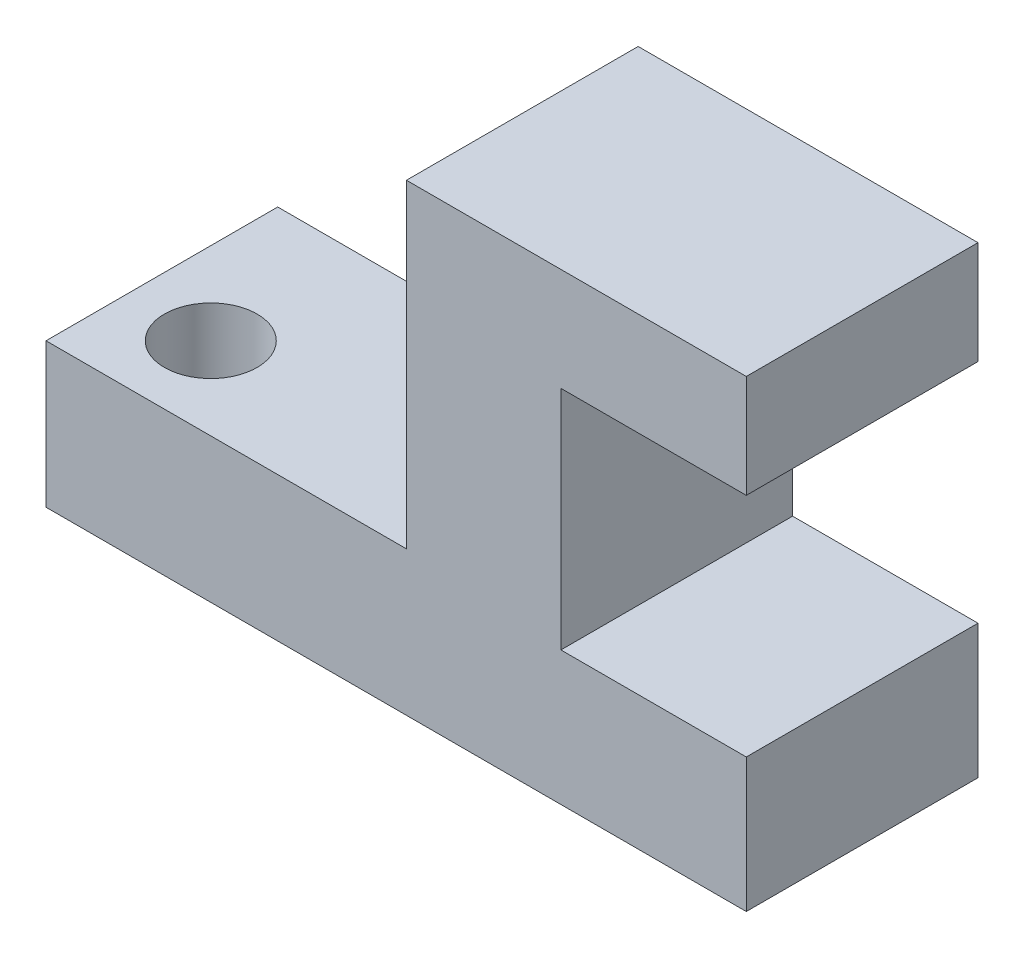
ISO-10303-21;
HEADER;
FILE_DESCRIPTION(('STEP AP214'),'2;1');
FILE_NAME('part.step','',(''),(''),'','','');
FILE_SCHEMA(('AUTOMOTIVE_DESIGN { 1 0 10303 214 1 1 1 1 }'));
ENDSEC;
DATA;
#1=APPLICATION_CONTEXT('core data for automotive mechanical design processes');
#2=APPLICATION_PROTOCOL_DEFINITION('international standard','automotive_design',2000,#1);
#3=PRODUCT_CONTEXT('',#1,'mechanical');
#4=PRODUCT('Part','Part','',(#3));
#5=PRODUCT_RELATED_PRODUCT_CATEGORY('part','',(#4));
#6=PRODUCT_DEFINITION_FORMATION('','',#4);
#7=PRODUCT_DEFINITION_CONTEXT('part definition',#1,'design');
#8=PRODUCT_DEFINITION('design','',#6,#7);
#9=PRODUCT_DEFINITION_SHAPE('','',#8);
#10=(LENGTH_UNIT() NAMED_UNIT(*) SI_UNIT(.MILLI.,.METRE.));
#11=(NAMED_UNIT(*) PLANE_ANGLE_UNIT() SI_UNIT($,.RADIAN.));
#12=(NAMED_UNIT(*) SI_UNIT($,.STERADIAN.) SOLID_ANGLE_UNIT());
#13=UNCERTAINTY_MEASURE_WITH_UNIT(LENGTH_MEASURE(1.E-05),#10,'distance_accuracy_value','');
#14=(GEOMETRIC_REPRESENTATION_CONTEXT(3) GLOBAL_UNCERTAINTY_ASSIGNED_CONTEXT((#13)) GLOBAL_UNIT_ASSIGNED_CONTEXT((#10,
#11,#12)) REPRESENTATION_CONTEXT('',''));
#15=CARTESIAN_POINT('',(0.,0.,0.));
#16=DIRECTION('',(0.,0.,1.));
#17=DIRECTION('',(1.,0.,0.));
#18=AXIS2_PLACEMENT_3D('',#15,#16,#17);
#19=CARTESIAN_POINT('',(0.,2.6,4.5));
#20=DIRECTION('',(-1.,0.,0.));
#21=DIRECTION('',(0.,-1.,0.));
#22=AXIS2_PLACEMENT_3D('',#19,#20,#21);
#23=PLANE('',#22);
#24=DIRECTION('',(0.,1.,0.));
#25=VECTOR('',#24,1.);
#26=CARTESIAN_POINT('',(0.,2.6,0.));
#27=LINE('',#26,#25);
#28=CARTESIAN_POINT('',(0.,0.,0.));
#29=VERTEX_POINT('',#28);
#30=CARTESIAN_POINT('',(0.,2.6,0.));
#31=VERTEX_POINT('',#30);
#32=EDGE_CURVE('E143',#29,#31,#27,.T.);
#33=ORIENTED_EDGE('',*,*,#32,.T.);
#34=DIRECTION('',(0.,0.,-1.));
#35=VECTOR('',#34,1.);
#36=CARTESIAN_POINT('',(0.,2.6,4.5));
#37=LINE('',#36,#35);
#38=CARTESIAN_POINT('',(0.,2.6,4.5));
#39=VERTEX_POINT('',#38);
#40=EDGE_CURVE('E11',#39,#31,#37,.T.);
#41=ORIENTED_EDGE('',*,*,#40,.F.);
#42=DIRECTION('',(0.,1.,0.));
#43=VECTOR('',#42,1.);
#44=CARTESIAN_POINT('',(0.,2.6,4.5));
#45=LINE('',#44,#43);
#46=CARTESIAN_POINT('',(0.,0.,4.5));
#47=VERTEX_POINT('',#46);
#48=EDGE_CURVE('E161',#47,#39,#45,.T.);
#49=ORIENTED_EDGE('',*,*,#48,.F.);
#50=DIRECTION('',(0.,0.,-1.));
#51=VECTOR('',#50,1.);
#52=CARTESIAN_POINT('',(0.,0.,4.5));
#53=LINE('',#52,#51);
#54=EDGE_CURVE('E139',#47,#29,#53,.T.);
#55=ORIENTED_EDGE('',*,*,#54,.T.);
#56=EDGE_LOOP('',(#33,#41,#49,#55));
#57=FACE_BOUND('',#56,.T.);
#58=ADVANCED_FACE('F33',(#57),#23,.F.);
#59=CARTESIAN_POINT('',(-3.6,2.6,4.5));
#60=DIRECTION('',(0.,-1.,0.));
#61=DIRECTION('',(0.,0.,-1.));
#62=AXIS2_PLACEMENT_3D('',#59,#60,#61);
#63=PLANE('',#62);
#64=DIRECTION('',(-1.,0.,0.));
#65=VECTOR('',#64,1.);
#66=CARTESIAN_POINT('',(-3.6,2.6,0.));
#67=LINE('',#66,#65);
#68=CARTESIAN_POINT('',(-3.6,2.6,0.));
#69=VERTEX_POINT('',#68);
#70=EDGE_CURVE('E146',#31,#69,#67,.T.);
#71=ORIENTED_EDGE('',*,*,#70,.T.);
#72=DIRECTION('',(0.,0.,-1.));
#73=VECTOR('',#72,1.);
#74=CARTESIAN_POINT('',(-3.6,2.6,4.5));
#75=LINE('',#74,#73);
#76=CARTESIAN_POINT('',(-3.6,2.6,4.5));
#77=VERTEX_POINT('',#76);
#78=EDGE_CURVE('E42',#77,#69,#75,.T.);
#79=ORIENTED_EDGE('',*,*,#78,.F.);
#80=DIRECTION('',(-1.,0.,0.));
#81=VECTOR('',#80,1.);
#82=CARTESIAN_POINT('',(-3.6,2.6,4.5));
#83=LINE('',#82,#81);
#84=EDGE_CURVE('E100',#39,#77,#83,.T.);
#85=ORIENTED_EDGE('',*,*,#84,.F.);
#86=ORIENTED_EDGE('',*,*,#40,.T.);
#87=EDGE_LOOP('',(#71,#79,#85,#86));
#88=FACE_BOUND('',#87,.T.);
#89=ADVANCED_FACE('F230',(#88),#63,.F.);
#90=CARTESIAN_POINT('',(-3.6,7.,4.5));
#91=DIRECTION('',(-1.,0.,0.));
#92=DIRECTION('',(0.,-1.,0.));
#93=AXIS2_PLACEMENT_3D('',#90,#91,#92);
#94=PLANE('',#93);
#95=DIRECTION('',(0.,1.,0.));
#96=VECTOR('',#95,1.);
#97=CARTESIAN_POINT('',(-3.6,7.,0.));
#98=LINE('',#97,#96);
#99=CARTESIAN_POINT('',(-3.6,7.,0.));
#100=VERTEX_POINT('',#99);
#101=EDGE_CURVE('E148',#69,#100,#98,.T.);
#102=ORIENTED_EDGE('',*,*,#101,.T.);
#103=DIRECTION('',(0.,0.,-1.));
#104=VECTOR('',#103,1.);
#105=CARTESIAN_POINT('',(-3.6,7.,4.5));
#106=LINE('',#105,#104);
#107=CARTESIAN_POINT('',(-3.6,7.,4.5));
#108=VERTEX_POINT('',#107);
#109=EDGE_CURVE('E174',#108,#100,#106,.T.);
#110=ORIENTED_EDGE('',*,*,#109,.F.);
#111=DIRECTION('',(0.,1.,0.));
#112=VECTOR('',#111,1.);
#113=CARTESIAN_POINT('',(-3.6,7.,4.5));
#114=LINE('',#113,#112);
#115=EDGE_CURVE('E194',#77,#108,#114,.T.);
#116=ORIENTED_EDGE('',*,*,#115,.F.);
#117=ORIENTED_EDGE('',*,*,#78,.T.);
#118=EDGE_LOOP('',(#102,#110,#116,#117));
#119=FACE_BOUND('',#118,.T.);
#120=ADVANCED_FACE('F234',(#119),#94,.F.);
#121=CARTESIAN_POINT('',(0.,7.,4.5));
#122=DIRECTION('',(0.,1.,0.));
#123=DIRECTION('',(-1.,0.,0.));
#124=AXIS2_PLACEMENT_3D('',#121,#122,#123);
#125=PLANE('',#124);
#126=DIRECTION('',(1.,0.,0.));
#127=VECTOR('',#126,1.);
#128=CARTESIAN_POINT('',(0.,7.,0.));
#129=LINE('',#128,#127);
#130=CARTESIAN_POINT('',(0.,7.,0.));
#131=VERTEX_POINT('',#130);
#132=EDGE_CURVE('E150',#100,#131,#129,.T.);
#133=ORIENTED_EDGE('',*,*,#132,.T.);
#134=DIRECTION('',(0.,0.,-1.));
#135=VECTOR('',#134,1.);
#136=CARTESIAN_POINT('',(0.,7.,4.5));
#137=LINE('',#136,#135);
#138=CARTESIAN_POINT('',(0.,7.,4.5));
#139=VERTEX_POINT('',#138);
#140=EDGE_CURVE('E171',#139,#131,#137,.T.);
#141=ORIENTED_EDGE('',*,*,#140,.F.);
#142=DIRECTION('',(1.,0.,0.));
#143=VECTOR('',#142,1.);
#144=CARTESIAN_POINT('',(0.,7.,4.5));
#145=LINE('',#144,#143);
#146=EDGE_CURVE('E196',#108,#139,#145,.T.);
#147=ORIENTED_EDGE('',*,*,#146,.F.);
#148=ORIENTED_EDGE('',*,*,#109,.T.);
#149=EDGE_LOOP('',(#133,#141,#147,#148));
#150=FACE_BOUND('',#149,.T.);
#151=ADVANCED_FACE('F238',(#150),#125,.F.);
#152=CARTESIAN_POINT('',(0.,9.,4.5));
#153=DIRECTION('',(-1.,0.,0.));
#154=DIRECTION('',(0.,-1.,0.));
#155=AXIS2_PLACEMENT_3D('',#152,#153,#154);
#156=PLANE('',#155);
#157=DIRECTION('',(0.,1.,0.));
#158=VECTOR('',#157,1.);
#159=CARTESIAN_POINT('',(0.,9.,0.));
#160=LINE('',#159,#158);
#161=CARTESIAN_POINT('',(0.,9.,0.));
#162=VERTEX_POINT('',#161);
#163=EDGE_CURVE('E152',#131,#162,#160,.T.);
#164=ORIENTED_EDGE('',*,*,#163,.T.);
#165=DIRECTION('',(0.,0.,-1.));
#166=VECTOR('',#165,1.);
#167=CARTESIAN_POINT('',(0.,9.,4.5));
#168=LINE('',#167,#166);
#169=CARTESIAN_POINT('',(0.,9.,4.5));
#170=VERTEX_POINT('',#169);
#171=EDGE_CURVE('E168',#170,#162,#168,.T.);
#172=ORIENTED_EDGE('',*,*,#171,.F.);
#173=DIRECTION('',(0.,1.,0.));
#174=VECTOR('',#173,1.);
#175=CARTESIAN_POINT('',(0.,9.,4.5));
#176=LINE('',#175,#174);
#177=EDGE_CURVE('E198',#139,#170,#176,.T.);
#178=ORIENTED_EDGE('',*,*,#177,.F.);
#179=ORIENTED_EDGE('',*,*,#140,.T.);
#180=EDGE_LOOP('',(#164,#172,#178,#179));
#181=FACE_BOUND('',#180,.T.);
#182=ADVANCED_FACE('F244',(#181),#156,.F.);
#183=CARTESIAN_POINT('',(-6.6,9.,4.5));
#184=DIRECTION('',(0.,-1.,0.));
#185=DIRECTION('',(0.,0.,-1.));
#186=AXIS2_PLACEMENT_3D('',#183,#184,#185);
#187=PLANE('',#186);
#188=DIRECTION('',(-1.,0.,0.));
#189=VECTOR('',#188,1.);
#190=CARTESIAN_POINT('',(-6.6,9.,0.));
#191=LINE('',#190,#189);
#192=CARTESIAN_POINT('',(-6.6,9.,0.));
#193=VERTEX_POINT('',#192);
#194=EDGE_CURVE('E154',#162,#193,#191,.T.);
#195=ORIENTED_EDGE('',*,*,#194,.T.);
#196=DIRECTION('',(0.,0.,-1.));
#197=VECTOR('',#196,1.);
#198=CARTESIAN_POINT('',(-6.6,9.,4.5));
#199=LINE('',#198,#197);
#200=CARTESIAN_POINT('',(-6.6,9.,4.5));
#201=VERTEX_POINT('',#200);
#202=EDGE_CURVE('E165',#201,#193,#199,.T.);
#203=ORIENTED_EDGE('',*,*,#202,.F.);
#204=DIRECTION('',(-1.,0.,0.));
#205=VECTOR('',#204,1.);
#206=CARTESIAN_POINT('',(-6.6,9.,4.5));
#207=LINE('',#206,#205);
#208=EDGE_CURVE('E200',#170,#201,#207,.T.);
#209=ORIENTED_EDGE('',*,*,#208,.F.);
#210=ORIENTED_EDGE('',*,*,#171,.T.);
#211=EDGE_LOOP('',(#195,#203,#209,#210));
#212=FACE_BOUND('',#211,.T.);
#213=ADVANCED_FACE('F206',(#212),#187,.F.);
#214=CARTESIAN_POINT('',(-6.6,2.8,4.5));
#215=DIRECTION('',(1.,0.,0.));
#216=DIRECTION('',(0.,1.,0.));
#217=AXIS2_PLACEMENT_3D('',#214,#215,#216);
#218=PLANE('',#217);
#219=DIRECTION('',(0.,-1.,0.));
#220=VECTOR('',#219,1.);
#221=CARTESIAN_POINT('',(-6.6,2.8,0.));
#222=LINE('',#221,#220);
#223=CARTESIAN_POINT('',(-6.6,2.8,0.));
#224=VERTEX_POINT('',#223);
#225=EDGE_CURVE('E156',#193,#224,#222,.T.);
#226=ORIENTED_EDGE('',*,*,#225,.T.);
#227=DIRECTION('',(0.,0.,-1.));
#228=VECTOR('',#227,1.);
#229=CARTESIAN_POINT('',(-6.6,2.8,4.5));
#230=LINE('',#229,#228);
#231=CARTESIAN_POINT('',(-6.6,2.8,4.5));
#232=VERTEX_POINT('',#231);
#233=EDGE_CURVE('E134',#232,#224,#230,.T.);
#234=ORIENTED_EDGE('',*,*,#233,.F.);
#235=DIRECTION('',(0.,-1.,0.));
#236=VECTOR('',#235,1.);
#237=CARTESIAN_POINT('',(-6.6,2.8,4.5));
#238=LINE('',#237,#236);
#239=EDGE_CURVE('E125',#201,#232,#238,.T.);
#240=ORIENTED_EDGE('',*,*,#239,.F.);
#241=ORIENTED_EDGE('',*,*,#202,.T.);
#242=EDGE_LOOP('',(#226,#234,#240,#241));
#243=FACE_BOUND('',#242,.T.);
#244=ADVANCED_FACE('F210',(#243),#218,.F.);
#245=CARTESIAN_POINT('',(-13.6,2.8,4.5));
#246=DIRECTION('',(0.,-1.,0.));
#247=DIRECTION('',(0.,0.,-1.));
#248=AXIS2_PLACEMENT_3D('',#245,#246,#247);
#249=PLANE('',#248);
#250=CARTESIAN_POINT('',(-8.2,2.8,1.6));
#251=DIRECTION('',(0.,1.,0.));
#252=DIRECTION('',(0.,0.,1.));
#253=AXIS2_PLACEMENT_3D('',#250,#251,#252);
#254=CIRCLE('',#253,0.899999999999999);
#255=CARTESIAN_POINT('',(-8.2,2.8,2.5));
#256=VERTEX_POINT('',#255);
#257=EDGE_CURVE('E180',#256,#256,#254,.T.);
#258=ORIENTED_EDGE('',*,*,#257,.F.);
#259=EDGE_LOOP('',(#258));
#260=FACE_BOUND('',#259,.T.);
#261=CARTESIAN_POINT('',(-12.,2.8,2.9));
#262=DIRECTION('',(0.,1.,0.));
#263=DIRECTION('',(0.,0.,1.));
#264=AXIS2_PLACEMENT_3D('',#261,#262,#263);
#265=CIRCLE('',#264,0.9);
#266=CARTESIAN_POINT('',(-12.,2.8,3.8));
#267=VERTEX_POINT('',#266);
#268=EDGE_CURVE('E185',#267,#267,#265,.T.);
#269=ORIENTED_EDGE('',*,*,#268,.F.);
#270=EDGE_LOOP('',(#269));
#271=FACE_BOUND('',#270,.T.);
#272=DIRECTION('',(-1.,0.,0.));
#273=VECTOR('',#272,1.);
#274=CARTESIAN_POINT('',(-13.6,2.8,0.));
#275=LINE('',#274,#273);
#276=CARTESIAN_POINT('',(-13.6,2.8,0.));
#277=VERTEX_POINT('',#276);
#278=EDGE_CURVE('E133',#224,#277,#275,.T.);
#279=ORIENTED_EDGE('',*,*,#278,.T.);
#280=DIRECTION('',(0.,0.,-1.));
#281=VECTOR('',#280,1.);
#282=CARTESIAN_POINT('',(-13.6,2.8,4.5));
#283=LINE('',#282,#281);
#284=CARTESIAN_POINT('',(-13.6,2.8,4.5));
#285=VERTEX_POINT('',#284);
#286=EDGE_CURVE('E130',#285,#277,#283,.T.);
#287=ORIENTED_EDGE('',*,*,#286,.F.);
#288=DIRECTION('',(-1.,0.,0.));
#289=VECTOR('',#288,1.);
#290=CARTESIAN_POINT('',(-13.6,2.8,4.5));
#291=LINE('',#290,#289);
#292=EDGE_CURVE('E119',#232,#285,#291,.T.);
#293=ORIENTED_EDGE('',*,*,#292,.F.);
#294=ORIENTED_EDGE('',*,*,#233,.T.);
#295=EDGE_LOOP('',(#279,#287,#293,#294));
#296=FACE_BOUND('',#295,.T.);
#297=ADVANCED_FACE('F131',(#260,#271,#296),#249,.F.);
#298=CARTESIAN_POINT('',(-13.6,0.,4.5));
#299=DIRECTION('',(1.,0.,0.));
#300=DIRECTION('',(0.,0.,-1.));
#301=AXIS2_PLACEMENT_3D('',#298,#299,#300);
#302=PLANE('',#301);
#303=DIRECTION('',(0.,-1.,0.));
#304=VECTOR('',#303,1.);
#305=CARTESIAN_POINT('',(-13.6,0.,0.));
#306=LINE('',#305,#304);
#307=CARTESIAN_POINT('',(-13.6,0.,0.));
#308=VERTEX_POINT('',#307);
#309=EDGE_CURVE('E86',#277,#308,#306,.T.);
#310=ORIENTED_EDGE('',*,*,#309,.T.);
#311=DIRECTION('',(0.,0.,-1.));
#312=VECTOR('',#311,1.);
#313=CARTESIAN_POINT('',(-13.6,0.,4.5));
#314=LINE('',#313,#312);
#315=CARTESIAN_POINT('',(-13.6,0.,4.5));
#316=VERTEX_POINT('',#315);
#317=EDGE_CURVE('E135',#316,#308,#314,.T.);
#318=ORIENTED_EDGE('',*,*,#317,.F.);
#319=DIRECTION('',(0.,-1.,0.));
#320=VECTOR('',#319,1.);
#321=CARTESIAN_POINT('',(-13.6,0.,4.5));
#322=LINE('',#321,#320);
#323=EDGE_CURVE('E123',#285,#316,#322,.T.);
#324=ORIENTED_EDGE('',*,*,#323,.F.);
#325=ORIENTED_EDGE('',*,*,#286,.T.);
#326=EDGE_LOOP('',(#310,#318,#324,#325));
#327=FACE_BOUND('',#326,.T.);
#328=ADVANCED_FACE('F137',(#327),#302,.F.);
#329=CARTESIAN_POINT('',(0.,0.,4.5));
#330=DIRECTION('',(0.,1.,0.));
#331=DIRECTION('',(-1.,0.,0.));
#332=AXIS2_PLACEMENT_3D('',#329,#330,#331);
#333=PLANE('',#332);
#334=CARTESIAN_POINT('',(-8.2,0.,1.6));
#335=DIRECTION('',(0.,1.,0.));
#336=DIRECTION('',(-1.,0.,0.));
#337=AXIS2_PLACEMENT_3D('',#334,#335,#336);
#338=CIRCLE('',#337,0.899999999999999);
#339=CARTESIAN_POINT('',(-9.1,0.,1.6));
#340=VERTEX_POINT('',#339);
#341=EDGE_CURVE('E36',#340,#340,#338,.T.);
#342=ORIENTED_EDGE('',*,*,#341,.T.);
#343=EDGE_LOOP('',(#342));
#344=FACE_BOUND('',#343,.T.);
#345=CARTESIAN_POINT('',(-12.,0.,2.9));
#346=DIRECTION('',(0.,1.,0.));
#347=DIRECTION('',(-1.,0.,0.));
#348=AXIS2_PLACEMENT_3D('',#345,#346,#347);
#349=CIRCLE('',#348,0.9);
#350=CARTESIAN_POINT('',(-12.9,0.,2.9));
#351=VERTEX_POINT('',#350);
#352=EDGE_CURVE('E178',#351,#351,#349,.T.);
#353=ORIENTED_EDGE('',*,*,#352,.T.);
#354=EDGE_LOOP('',(#353));
#355=FACE_BOUND('',#354,.T.);
#356=DIRECTION('',(1.,0.,0.));
#357=VECTOR('',#356,1.);
#358=CARTESIAN_POINT('',(0.,0.,0.));
#359=LINE('',#358,#357);
#360=EDGE_CURVE('E92',#308,#29,#359,.T.);
#361=ORIENTED_EDGE('',*,*,#360,.T.);
#362=ORIENTED_EDGE('',*,*,#54,.F.);
#363=DIRECTION('',(1.,0.,0.));
#364=VECTOR('',#363,1.);
#365=CARTESIAN_POINT('',(0.,0.,4.5));
#366=LINE('',#365,#364);
#367=EDGE_CURVE('E51',#316,#47,#366,.T.);
#368=ORIENTED_EDGE('',*,*,#367,.F.);
#369=ORIENTED_EDGE('',*,*,#317,.T.);
#370=EDGE_LOOP('',(#361,#362,#368,#369));
#371=FACE_BOUND('',#370,.T.);
#372=ADVANCED_FACE('F218',(#344,#355,#371),#333,.F.);
#373=CARTESIAN_POINT('',(0.,0.,4.5));
#374=DIRECTION('',(0.,0.,-1.));
#375=DIRECTION('',(-1.,0.,0.));
#376=AXIS2_PLACEMENT_3D('',#373,#374,#375);
#377=PLANE('',#376);
#378=ORIENTED_EDGE('',*,*,#48,.T.);
#379=ORIENTED_EDGE('',*,*,#84,.T.);
#380=ORIENTED_EDGE('',*,*,#115,.T.);
#381=ORIENTED_EDGE('',*,*,#146,.T.);
#382=ORIENTED_EDGE('',*,*,#177,.T.);
#383=ORIENTED_EDGE('',*,*,#208,.T.);
#384=ORIENTED_EDGE('',*,*,#239,.T.);
#385=ORIENTED_EDGE('',*,*,#292,.T.);
#386=ORIENTED_EDGE('',*,*,#323,.T.);
#387=ORIENTED_EDGE('',*,*,#367,.T.);
#388=EDGE_LOOP('',(#378,#379,#380,#381,#382,#383,#384,#385,#386,#387));
#389=FACE_BOUND('',#388,.T.);
#390=ADVANCED_FACE('F121',(#389),#377,.F.);
#391=CARTESIAN_POINT('',(0.,0.,0.));
#392=DIRECTION('',(0.,0.,-1.));
#393=DIRECTION('',(-1.,0.,0.));
#394=AXIS2_PLACEMENT_3D('',#391,#392,#393);
#395=PLANE('',#394);
#396=ORIENTED_EDGE('',*,*,#32,.F.);
#397=ORIENTED_EDGE('',*,*,#360,.F.);
#398=ORIENTED_EDGE('',*,*,#309,.F.);
#399=ORIENTED_EDGE('',*,*,#278,.F.);
#400=ORIENTED_EDGE('',*,*,#225,.F.);
#401=ORIENTED_EDGE('',*,*,#194,.F.);
#402=ORIENTED_EDGE('',*,*,#163,.F.);
#403=ORIENTED_EDGE('',*,*,#132,.F.);
#404=ORIENTED_EDGE('',*,*,#101,.F.);
#405=ORIENTED_EDGE('',*,*,#70,.F.);
#406=EDGE_LOOP('',(#396,#397,#398,#399,#400,#401,#402,#403,#404,#405));
#407=FACE_BOUND('',#406,.T.);
#408=ADVANCED_FACE('F213',(#407),#395,.T.);
#409=CARTESIAN_POINT('',(-12.,-7.2,2.9));
#410=DIRECTION('',(0.,1.,0.));
#411=DIRECTION('',(0.,0.,1.));
#412=AXIS2_PLACEMENT_3D('',#409,#410,#411);
#413=CYLINDRICAL_SURFACE('',#412,0.9);
#414=ORIENTED_EDGE('',*,*,#268,.T.);
#415=EDGE_LOOP('',(#414));
#416=FACE_BOUND('',#415,.T.);
#417=ORIENTED_EDGE('',*,*,#352,.F.);
#418=EDGE_LOOP('',(#417));
#419=FACE_BOUND('',#418,.T.);
#420=ADVANCED_FACE('F260',(#416,#419),#413,.F.);
#421=CARTESIAN_POINT('',(-8.2,-7.2,1.6));
#422=DIRECTION('',(0.,1.,0.));
#423=DIRECTION('',(0.,0.,1.));
#424=AXIS2_PLACEMENT_3D('',#421,#422,#423);
#425=CYLINDRICAL_SURFACE('',#424,0.899999999999999);
#426=ORIENTED_EDGE('',*,*,#257,.T.);
#427=EDGE_LOOP('',(#426));
#428=FACE_BOUND('',#427,.T.);
#429=ORIENTED_EDGE('',*,*,#341,.F.);
#430=EDGE_LOOP('',(#429));
#431=FACE_BOUND('',#430,.T.);
#432=ADVANCED_FACE('F263',(#428,#431),#425,.F.);
#433=CLOSED_SHELL('',(#58,#89,#120,#151,#182,#213,#244,#297,#328,#372,#390,#408,#420,#432));
#434=MANIFOLD_SOLID_BREP('B2',#433);
#435=ADVANCED_BREP_SHAPE_REPRESENTATION('',(#18,#434),#14);
#436=SHAPE_DEFINITION_REPRESENTATION(#9,#435);
ENDSEC;
END-ISO-10303-21;
